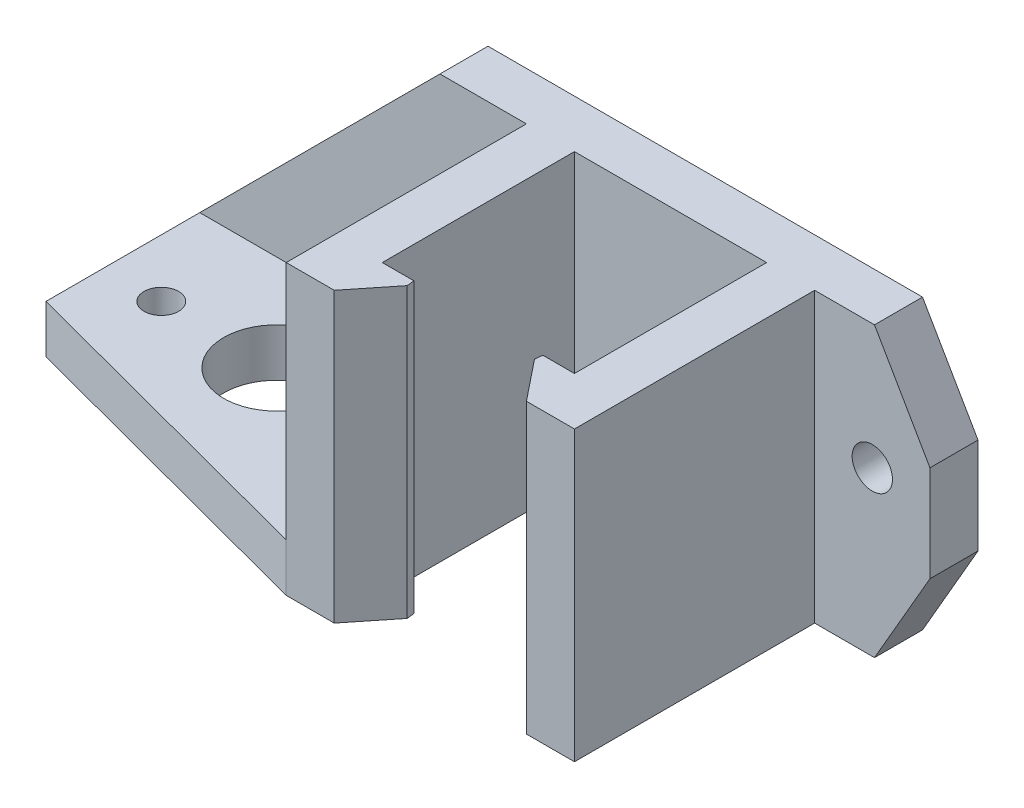
ISO-10303-21;
HEADER;
FILE_DESCRIPTION(('STEP AP214'),'2;1');
FILE_NAME('part.step','',(''),(''),'','','');
FILE_SCHEMA(('AUTOMOTIVE_DESIGN { 1 0 10303 214 1 1 1 1 }'));
ENDSEC;
DATA;
#1=APPLICATION_CONTEXT('core data for automotive mechanical design processes');
#2=APPLICATION_PROTOCOL_DEFINITION('international standard','automotive_design',2000,#1);
#3=PRODUCT_CONTEXT('',#1,'mechanical');
#4=PRODUCT('Part','Part','',(#3));
#5=PRODUCT_RELATED_PRODUCT_CATEGORY('part','',(#4));
#6=PRODUCT_DEFINITION_FORMATION('','',#4);
#7=PRODUCT_DEFINITION_CONTEXT('part definition',#1,'design');
#8=PRODUCT_DEFINITION('design','',#6,#7);
#9=PRODUCT_DEFINITION_SHAPE('','',#8);
#10=(LENGTH_UNIT() NAMED_UNIT(*) SI_UNIT(.MILLI.,.METRE.));
#11=(NAMED_UNIT(*) PLANE_ANGLE_UNIT() SI_UNIT($,.RADIAN.));
#12=(NAMED_UNIT(*) SI_UNIT($,.STERADIAN.) SOLID_ANGLE_UNIT());
#13=UNCERTAINTY_MEASURE_WITH_UNIT(LENGTH_MEASURE(1.E-05),#10,'distance_accuracy_value','');
#14=(GEOMETRIC_REPRESENTATION_CONTEXT(3) GLOBAL_UNCERTAINTY_ASSIGNED_CONTEXT((#13)) GLOBAL_UNIT_ASSIGNED_CONTEXT((#10,
#11,#12)) REPRESENTATION_CONTEXT('',''));
#15=CARTESIAN_POINT('',(0.,0.,0.));
#16=DIRECTION('',(0.,0.,1.));
#17=DIRECTION('',(1.,0.,0.));
#18=AXIS2_PLACEMENT_3D('',#15,#16,#17);
#19=CARTESIAN_POINT('',(15.,30.,15.));
#20=DIRECTION('',(0.,0.,-1.));
#21=DIRECTION('',(1.,0.,0.));
#22=AXIS2_PLACEMENT_3D('',#19,#20,#21);
#23=PLANE('',#22);
#24=DIRECTION('',(-1.,0.,0.));
#25=VECTOR('',#24,1.);
#26=CARTESIAN_POINT('',(15.,0.,15.));
#27=LINE('',#26,#25);
#28=CARTESIAN_POINT('',(-10.,0.,15.));
#29=VERTEX_POINT('',#28);
#30=CARTESIAN_POINT('',(-15.,0.,15.));
#31=VERTEX_POINT('',#30);
#32=EDGE_CURVE('E230',#29,#31,#27,.T.);
#33=ORIENTED_EDGE('',*,*,#32,.F.);
#34=DIRECTION('',(0.,1.,0.));
#35=VECTOR('',#34,1.);
#36=CARTESIAN_POINT('',(-10.,-5.00000000014378E-05,15.));
#37=LINE('',#36,#35);
#38=CARTESIAN_POINT('',(-10.,30.,15.));
#39=VERTEX_POINT('',#38);
#40=EDGE_CURVE('E192',#29,#39,#37,.T.);
#41=ORIENTED_EDGE('',*,*,#40,.T.);
#42=DIRECTION('',(-1.,0.,0.));
#43=VECTOR('',#42,1.);
#44=CARTESIAN_POINT('',(15.,30.,15.));
#45=LINE('',#44,#43);
#46=CARTESIAN_POINT('',(-15.,30.,15.));
#47=VERTEX_POINT('',#46);
#48=EDGE_CURVE('E208',#39,#47,#45,.T.);
#49=ORIENTED_EDGE('',*,*,#48,.T.);
#50=DIRECTION('',(0.,-1.,0.));
#51=VECTOR('',#50,1.);
#52=CARTESIAN_POINT('',(-15.,30.,15.));
#53=LINE('',#52,#51);
#54=CARTESIAN_POINT('',(-15.,5.,15.));
#55=VERTEX_POINT('',#54);
#56=EDGE_CURVE('E220',#47,#55,#53,.T.);
#57=ORIENTED_EDGE('',*,*,#56,.T.);
#58=DIRECTION('',(0.,1.,0.));
#59=VECTOR('',#58,1.);
#60=CARTESIAN_POINT('',(-15.,0.,15.));
#61=LINE('',#60,#59);
#62=EDGE_CURVE('E276',#31,#55,#61,.T.);
#63=ORIENTED_EDGE('',*,*,#62,.F.);
#64=EDGE_LOOP('',(#33,#41,#49,#57,#63));
#65=FACE_BOUND('',#64,.T.);
#66=ADVANCED_FACE('F34',(#65),#23,.F.);
#67=CARTESIAN_POINT('',(10.,0.,10.));
#68=DIRECTION('',(0.,0.,1.));
#69=DIRECTION('',(-1.,0.,0.));
#70=AXIS2_PLACEMENT_3D('',#67,#68,#69);
#71=PLANE('',#70);
#72=DIRECTION('',(-1.,0.,0.));
#73=VECTOR('',#72,1.);
#74=CARTESIAN_POINT('',(10.,30.,10.));
#75=LINE('',#74,#73);
#76=CARTESIAN_POINT('',(-6.71145824860367,30.,10.));
#77=VERTEX_POINT('',#76);
#78=CARTESIAN_POINT('',(-10.,30.,10.));
#79=VERTEX_POINT('',#78);
#80=EDGE_CURVE('E355',#77,#79,#75,.T.);
#81=ORIENTED_EDGE('',*,*,#80,.F.);
#82=DIRECTION('',(0.,-1.,0.));
#83=VECTOR('',#82,1.);
#84=CARTESIAN_POINT('',(-6.71145824860367,0.,10.));
#85=LINE('',#84,#83);
#86=CARTESIAN_POINT('',(-6.71145824860367,0.,10.));
#87=VERTEX_POINT('',#86);
#88=EDGE_CURVE('E42',#77,#87,#85,.T.);
#89=ORIENTED_EDGE('',*,*,#88,.T.);
#90=DIRECTION('',(-1.,0.,0.));
#91=VECTOR('',#90,1.);
#92=CARTESIAN_POINT('',(10.,0.,10.));
#93=LINE('',#92,#91);
#94=CARTESIAN_POINT('',(-10.,0.,10.));
#95=VERTEX_POINT('',#94);
#96=EDGE_CURVE('E353',#87,#95,#93,.T.);
#97=ORIENTED_EDGE('',*,*,#96,.T.);
#98=DIRECTION('',(0.,1.,0.));
#99=VECTOR('',#98,1.);
#100=CARTESIAN_POINT('',(-10.,0.,10.));
#101=LINE('',#100,#99);
#102=EDGE_CURVE('E384',#95,#79,#101,.T.);
#103=ORIENTED_EDGE('',*,*,#102,.T.);
#104=EDGE_LOOP('',(#81,#89,#97,#103));
#105=FACE_BOUND('',#104,.T.);
#106=ADVANCED_FACE('F351',(#105),#71,.F.);
#107=CARTESIAN_POINT('',(15.,30.,-15.));
#108=DIRECTION('',(-1.,0.,0.));
#109=DIRECTION('',(0.,0.,-1.));
#110=AXIS2_PLACEMENT_3D('',#107,#108,#109);
#111=PLANE('',#110);
#112=DIRECTION('',(0.,1.,0.));
#113=VECTOR('',#112,1.);
#114=CARTESIAN_POINT('',(15.,30.,-10.));
#115=LINE('',#114,#113);
#116=CARTESIAN_POINT('',(15.,0.,-10.));
#117=VERTEX_POINT('',#116);
#118=CARTESIAN_POINT('',(15.,30.,-10.));
#119=VERTEX_POINT('',#118);
#120=EDGE_CURVE('E236',#117,#119,#115,.T.);
#121=ORIENTED_EDGE('',*,*,#120,.T.);
#122=DIRECTION('',(0.,0.,1.));
#123=VECTOR('',#122,1.);
#124=CARTESIAN_POINT('',(15.,30.,-15.));
#125=LINE('',#124,#123);
#126=CARTESIAN_POINT('',(15.,30.,15.));
#127=VERTEX_POINT('',#126);
#128=EDGE_CURVE('E213',#119,#127,#125,.T.);
#129=ORIENTED_EDGE('',*,*,#128,.T.);
#130=DIRECTION('',(0.,-1.,0.));
#131=VECTOR('',#130,1.);
#132=CARTESIAN_POINT('',(15.,30.,15.));
#133=LINE('',#132,#131);
#134=CARTESIAN_POINT('',(15.,0.,15.));
#135=VERTEX_POINT('',#134);
#136=EDGE_CURVE('E205',#127,#135,#133,.T.);
#137=ORIENTED_EDGE('',*,*,#136,.T.);
#138=DIRECTION('',(0.,0.,1.));
#139=VECTOR('',#138,1.);
#140=CARTESIAN_POINT('',(15.,0.,-15.));
#141=LINE('',#140,#139);
#142=EDGE_CURVE('E226',#117,#135,#141,.T.);
#143=ORIENTED_EDGE('',*,*,#142,.F.);
#144=EDGE_LOOP('',(#121,#129,#137,#143));
#145=FACE_BOUND('',#144,.T.);
#146=ADVANCED_FACE('F430',(#145),#111,.F.);
#147=CARTESIAN_POINT('',(-15.,30.,-15.));
#148=DIRECTION('',(1.,0.,0.));
#149=DIRECTION('',(0.,0.,1.));
#150=AXIS2_PLACEMENT_3D('',#147,#148,#149);
#151=PLANE('',#150);
#152=DIRECTION('',(0.,-1.,0.));
#153=VECTOR('',#152,1.);
#154=CARTESIAN_POINT('',(-15.,30.,-10.));
#155=LINE('',#154,#153);
#156=CARTESIAN_POINT('',(-15.,30.,-10.));
#157=VERTEX_POINT('',#156);
#158=CARTESIAN_POINT('',(-15.,5.,-10.));
#159=VERTEX_POINT('',#158);
#160=EDGE_CURVE('E252',#157,#159,#155,.T.);
#161=ORIENTED_EDGE('',*,*,#160,.T.);
#162=DIRECTION('',(0.,0.,1.));
#163=VECTOR('',#162,1.);
#164=CARTESIAN_POINT('',(-15.,5.,15.));
#165=LINE('',#164,#163);
#166=EDGE_CURVE('E296',#159,#55,#165,.T.);
#167=ORIENTED_EDGE('',*,*,#166,.T.);
#168=ORIENTED_EDGE('',*,*,#56,.F.);
#169=DIRECTION('',(0.,0.,-1.));
#170=VECTOR('',#169,1.);
#171=CARTESIAN_POINT('',(-15.,30.,-15.));
#172=LINE('',#171,#170);
#173=EDGE_CURVE('E207',#47,#157,#172,.T.);
#174=ORIENTED_EDGE('',*,*,#173,.T.);
#175=EDGE_LOOP('',(#161,#167,#168,#174));
#176=FACE_BOUND('',#175,.T.);
#177=ADVANCED_FACE('F466',(#176),#151,.F.);
#178=CARTESIAN_POINT('',(-55.,5.,15.));
#179=DIRECTION('',(0.,-1.,0.));
#180=DIRECTION('',(0.,0.,-1.));
#181=AXIS2_PLACEMENT_3D('',#178,#179,#180);
#182=PLANE('',#181);
#183=CARTESIAN_POINT('',(-31.,5.,0.));
#184=DIRECTION('',(0.,1.,0.));
#185=DIRECTION('',(0.,0.,-1.));
#186=AXIS2_PLACEMENT_3D('',#183,#184,#185);
#187=CIRCLE('',#186,5.5);
#188=CARTESIAN_POINT('',(-31.,5.,-5.49999999999999));
#189=VERTEX_POINT('',#188);
#190=EDGE_CURVE('E290',#189,#189,#187,.T.);
#191=ORIENTED_EDGE('',*,*,#190,.F.);
#192=EDGE_LOOP('',(#191));
#193=FACE_BOUND('',#192,.T.);
#194=CARTESIAN_POINT('',(-19.,5.,0.));
#195=DIRECTION('',(0.,1.,0.));
#196=DIRECTION('',(0.,0.,-1.));
#197=AXIS2_PLACEMENT_3D('',#194,#195,#196);
#198=CIRCLE('',#197,1.8);
#199=CARTESIAN_POINT('',(-19.,5.,-1.8));
#200=VERTEX_POINT('',#199);
#201=EDGE_CURVE('E286',#200,#200,#198,.T.);
#202=ORIENTED_EDGE('',*,*,#201,.F.);
#203=EDGE_LOOP('',(#202));
#204=FACE_BOUND('',#203,.T.);
#205=CARTESIAN_POINT('',(-43.,5.,0.));
#206=DIRECTION('',(0.,1.,0.));
#207=DIRECTION('',(0.,0.,-1.));
#208=AXIS2_PLACEMENT_3D('',#205,#206,#207);
#209=CIRCLE('',#208,1.8);
#210=CARTESIAN_POINT('',(-43.,5.,-1.8));
#211=VERTEX_POINT('',#210);
#212=EDGE_CURVE('E282',#211,#211,#209,.T.);
#213=ORIENTED_EDGE('',*,*,#212,.F.);
#214=EDGE_LOOP('',(#213));
#215=FACE_BOUND('',#214,.T.);
#216=DIRECTION('',(1.,0.,0.));
#217=VECTOR('',#216,1.);
#218=CARTESIAN_POINT('',(-74.4950975679639,5.,-10.));
#219=LINE('',#218,#217);
#220=CARTESIAN_POINT('',(-49.,5.,-9.99999999999999));
#221=VERTEX_POINT('',#220);
#222=EDGE_CURVE('E259',#221,#159,#219,.T.);
#223=ORIENTED_EDGE('',*,*,#222,.F.);
#224=DIRECTION('',(0.,0.,1.));
#225=VECTOR('',#224,1.);
#226=CARTESIAN_POINT('',(-49.,5.,6.));
#227=LINE('',#226,#225);
#228=CARTESIAN_POINT('',(-49.,5.,6.));
#229=VERTEX_POINT('',#228);
#230=EDGE_CURVE('E263',#221,#229,#227,.T.);
#231=ORIENTED_EDGE('',*,*,#230,.T.);
#232=DIRECTION('',(0.966705227861512,0.,0.255892560316283));
#233=VECTOR('',#232,1.);
#234=CARTESIAN_POINT('',(-15.,5.,15.));
#235=LINE('',#234,#233);
#236=EDGE_CURVE('E268',#229,#55,#235,.T.);
#237=ORIENTED_EDGE('',*,*,#236,.T.);
#238=ORIENTED_EDGE('',*,*,#166,.F.);
#239=EDGE_LOOP('',(#223,#231,#237,#238));
#240=FACE_BOUND('',#239,.T.);
#241=ADVANCED_FACE('F457',(#193,#204,#215,#240),#182,.F.);
#242=CARTESIAN_POINT('',(10.,30.,15.));
#243=VERTEX_POINT('',#242);
#244=EDGE_CURVE('E199',#127,#243,#45,.T.);
#245=ORIENTED_EDGE('',*,*,#244,.T.);
#246=DIRECTION('',(0.,1.,0.));
#247=VECTOR('',#246,1.);
#248=CARTESIAN_POINT('',(10.,-5.00000000014378E-05,15.));
#249=LINE('',#248,#247);
#250=CARTESIAN_POINT('',(10.,0.,15.));
#251=VERTEX_POINT('',#250);
#252=EDGE_CURVE('E182',#251,#243,#249,.T.);
#253=ORIENTED_EDGE('',*,*,#252,.F.);
#254=EDGE_CURVE('E223',#135,#251,#27,.T.);
#255=ORIENTED_EDGE('',*,*,#254,.F.);
#256=ORIENTED_EDGE('',*,*,#136,.F.);
#257=EDGE_LOOP('',(#245,#253,#255,#256));
#258=FACE_BOUND('',#257,.T.);
#259=ADVANCED_FACE('F203',(#258),#23,.F.);
#260=CARTESIAN_POINT('',(15.,30.,-15.));
#261=DIRECTION('',(0.,0.,1.));
#262=DIRECTION('',(-1.,0.,0.));
#263=AXIS2_PLACEMENT_3D('',#260,#261,#262);
#264=PLANE('',#263);
#265=CARTESIAN_POINT('',(21.,17.,-15.));
#266=DIRECTION('',(0.,0.,-1.));
#267=DIRECTION('',(-1.,0.,0.));
#268=AXIS2_PLACEMENT_3D('',#265,#266,#267);
#269=CIRCLE('',#268,2.1);
#270=CARTESIAN_POINT('',(18.9,17.,-15.));
#271=VERTEX_POINT('',#270);
#272=EDGE_CURVE('E241',#271,#271,#269,.T.);
#273=ORIENTED_EDGE('',*,*,#272,.F.);
#274=EDGE_LOOP('',(#273));
#275=FACE_BOUND('',#274,.T.);
#276=CARTESIAN_POINT('',(-23.,17.,-15.));
#277=DIRECTION('',(0.,0.,-1.));
#278=DIRECTION('',(-1.,0.,0.));
#279=AXIS2_PLACEMENT_3D('',#276,#277,#278);
#280=CIRCLE('',#279,2.1);
#281=CARTESIAN_POINT('',(-25.1,17.,-15.));
#282=VERTEX_POINT('',#281);
#283=EDGE_CURVE('E249',#282,#282,#280,.T.);
#284=ORIENTED_EDGE('',*,*,#283,.F.);
#285=EDGE_LOOP('',(#284));
#286=FACE_BOUND('',#285,.T.);
#287=DIRECTION('',(0.,-1.,0.));
#288=VECTOR('',#287,1.);
#289=CARTESIAN_POINT('',(27.,30.,-15.));
#290=LINE('',#289,#288);
#291=CARTESIAN_POINT('',(27.,20.,-15.));
#292=VERTEX_POINT('',#291);
#293=CARTESIAN_POINT('',(27.,10.,-15.));
#294=VERTEX_POINT('',#293);
#295=EDGE_CURVE('E240',#292,#294,#290,.T.);
#296=ORIENTED_EDGE('',*,*,#295,.T.);
#297=DIRECTION('',(0.499999999999998,0.86602540378444,0.));
#298=VECTOR('',#297,1.);
#299=CARTESIAN_POINT('',(27.,10.,-15.));
#300=LINE('',#299,#298);
#301=CARTESIAN_POINT('',(21.2264973081038,0.,-15.));
#302=VERTEX_POINT('',#301);
#303=EDGE_CURVE('E318',#302,#294,#300,.T.);
#304=ORIENTED_EDGE('',*,*,#303,.F.);
#305=DIRECTION('',(1.,0.,0.));
#306=VECTOR('',#305,1.);
#307=CARTESIAN_POINT('',(15.,0.,-15.));
#308=LINE('',#307,#306);
#309=CARTESIAN_POINT('',(-49.,0.,-15.));
#310=VERTEX_POINT('',#309);
#311=EDGE_CURVE('E235',#310,#302,#308,.T.);
#312=ORIENTED_EDGE('',*,*,#311,.F.);
#313=DIRECTION('',(0.,1.,0.));
#314=VECTOR('',#313,1.);
#315=CARTESIAN_POINT('',(-49.,0.,-15.));
#316=LINE('',#315,#314);
#317=CARTESIAN_POINT('',(-49.,4.9999999999999,-15.));
#318=VERTEX_POINT('',#317);
#319=EDGE_CURVE('E271',#310,#318,#316,.T.);
#320=ORIENTED_EDGE('',*,*,#319,.T.);
#321=DIRECTION('',(-0.707106781186546,-0.707106781186549,0.));
#322=VECTOR('',#321,1.);
#323=CARTESIAN_POINT('',(-24.,30.,-15.));
#324=LINE('',#323,#322);
#325=CARTESIAN_POINT('',(-24.,30.,-15.));
#326=VERTEX_POINT('',#325);
#327=EDGE_CURVE('E305',#326,#318,#324,.T.);
#328=ORIENTED_EDGE('',*,*,#327,.F.);
#329=DIRECTION('',(1.,0.,0.));
#330=VECTOR('',#329,1.);
#331=CARTESIAN_POINT('',(15.,30.,-15.));
#332=LINE('',#331,#330);
#333=CARTESIAN_POINT('',(21.2264973081038,30.,-15.));
#334=VERTEX_POINT('',#333);
#335=EDGE_CURVE('E211',#326,#334,#332,.T.);
#336=ORIENTED_EDGE('',*,*,#335,.T.);
#337=DIRECTION('',(0.499999999999998,-0.86602540378444,0.));
#338=VECTOR('',#337,1.);
#339=CARTESIAN_POINT('',(27.,20.,-15.));
#340=LINE('',#339,#338);
#341=EDGE_CURVE('E323',#292,#334,#340,.F.);
#342=ORIENTED_EDGE('',*,*,#341,.F.);
#343=EDGE_LOOP('',(#296,#304,#312,#320,#328,#336,#342));
#344=FACE_BOUND('',#343,.T.);
#345=ADVANCED_FACE('F435',(#275,#286,#344),#264,.F.);
#346=CARTESIAN_POINT('',(0.,30.,0.));
#347=DIRECTION('',(0.,1.,0.));
#348=DIRECTION('',(0.,0.,1.));
#349=AXIS2_PLACEMENT_3D('',#346,#347,#348);
#350=PLANE('',#349);
#351=CARTESIAN_POINT('',(10.,30.,10.));
#352=VERTEX_POINT('',#351);
#353=CARTESIAN_POINT('',(6.71145824860366,30.,10.));
#354=VERTEX_POINT('',#353);
#355=EDGE_CURVE('E374',#352,#354,#75,.T.);
#356=ORIENTED_EDGE('',*,*,#355,.T.);
#357=DIRECTION('',(0.110431526074844,0.,-0.993883734673619));
#358=VECTOR('',#357,1.);
#359=CARTESIAN_POINT('',(7.72717217240116,30.,0.858574685822331));
#360=LINE('',#359,#358);
#361=CARTESIAN_POINT('',(6.62469504755444,30.,10.780868809443));
#362=VERTEX_POINT('',#361);
#363=EDGE_CURVE('E201',#354,#362,#360,.F.);
#364=ORIENTED_EDGE('',*,*,#363,.T.);
#365=DIRECTION('',(-0.624695047554424,0.,-0.78086880944303));
#366=VECTOR('',#365,1.);
#367=CARTESIAN_POINT('',(6.,30.,10.));
#368=LINE('',#367,#366);
#369=EDGE_CURVE('E185',#243,#362,#368,.T.);
#370=ORIENTED_EDGE('',*,*,#369,.F.);
#371=ORIENTED_EDGE('',*,*,#244,.F.);
#372=ORIENTED_EDGE('',*,*,#128,.F.);
#373=DIRECTION('',(-1.,0.,0.));
#374=VECTOR('',#373,1.);
#375=CARTESIAN_POINT('',(27.,30.,-10.));
#376=LINE('',#375,#374);
#377=CARTESIAN_POINT('',(21.2264973081038,30.,-10.));
#378=VERTEX_POINT('',#377);
#379=EDGE_CURVE('E327',#378,#119,#376,.T.);
#380=ORIENTED_EDGE('',*,*,#379,.F.);
#381=DIRECTION('',(0.,0.,1.));
#382=VECTOR('',#381,1.);
#383=CARTESIAN_POINT('',(21.2264973081038,30.,0.));
#384=LINE('',#383,#382);
#385=EDGE_CURVE('E326',#334,#378,#384,.T.);
#386=ORIENTED_EDGE('',*,*,#385,.F.);
#387=ORIENTED_EDGE('',*,*,#335,.F.);
#388=DIRECTION('',(0.,0.,-1.));
#389=VECTOR('',#388,1.);
#390=CARTESIAN_POINT('',(-24.,30.,-15.));
#391=LINE('',#390,#389);
#392=CARTESIAN_POINT('',(-24.,30.,-10.));
#393=VERTEX_POINT('',#392);
#394=EDGE_CURVE('E303',#393,#326,#391,.T.);
#395=ORIENTED_EDGE('',*,*,#394,.F.);
#396=DIRECTION('',(1.,0.,0.));
#397=VECTOR('',#396,1.);
#398=CARTESIAN_POINT('',(-74.4950975679639,30.,-10.));
#399=LINE('',#398,#397);
#400=EDGE_CURVE('E261',#393,#157,#399,.T.);
#401=ORIENTED_EDGE('',*,*,#400,.T.);
#402=ORIENTED_EDGE('',*,*,#173,.F.);
#403=ORIENTED_EDGE('',*,*,#48,.F.);
#404=DIRECTION('',(-0.624695047554425,0.,0.78086880944303));
#405=VECTOR('',#404,1.);
#406=CARTESIAN_POINT('',(-10.,30.,15.));
#407=LINE('',#406,#405);
#408=CARTESIAN_POINT('',(-6.62469504755444,30.,10.780868809443));
#409=VERTEX_POINT('',#408);
#410=EDGE_CURVE('E193',#409,#39,#407,.T.);
#411=ORIENTED_EDGE('',*,*,#410,.F.);
#412=DIRECTION('',(0.110431526074849,0.,0.993883734673619));
#413=VECTOR('',#412,1.);
#414=CARTESIAN_POINT('',(-7.72717217240121,30.,0.858574685822379));
#415=LINE('',#414,#413);
#416=EDGE_CURVE('E342',#409,#77,#415,.F.);
#417=ORIENTED_EDGE('',*,*,#416,.T.);
#418=ORIENTED_EDGE('',*,*,#80,.T.);
#419=DIRECTION('',(0.,0.,-1.));
#420=VECTOR('',#419,1.);
#421=CARTESIAN_POINT('',(-10.,30.,-10.));
#422=LINE('',#421,#420);
#423=CARTESIAN_POINT('',(-10.,30.,-10.));
#424=VERTEX_POINT('',#423);
#425=EDGE_CURVE('E376',#79,#424,#422,.T.);
#426=ORIENTED_EDGE('',*,*,#425,.T.);
#427=DIRECTION('',(1.,0.,0.));
#428=VECTOR('',#427,1.);
#429=CARTESIAN_POINT('',(10.,30.,-10.));
#430=LINE('',#429,#428);
#431=CARTESIAN_POINT('',(10.,30.,-10.));
#432=VERTEX_POINT('',#431);
#433=EDGE_CURVE('E365',#424,#432,#430,.T.);
#434=ORIENTED_EDGE('',*,*,#433,.T.);
#435=DIRECTION('',(0.,0.,1.));
#436=VECTOR('',#435,1.);
#437=CARTESIAN_POINT('',(10.,30.,-10.));
#438=LINE('',#437,#436);
#439=EDGE_CURVE('E300',#432,#352,#438,.T.);
#440=ORIENTED_EDGE('',*,*,#439,.T.);
#441=EDGE_LOOP('',(#356,#364,#370,#371,#372,#380,#386,#387,#395,#401,#402,#403,#411,#417,#418,
#426,#434,#440));
#442=FACE_BOUND('',#441,.T.);
#443=ADVANCED_FACE('F197',(#442),#350,.T.);
#444=CARTESIAN_POINT('',(0.,0.,0.));
#445=DIRECTION('',(0.,1.,0.));
#446=DIRECTION('',(0.,0.,1.));
#447=AXIS2_PLACEMENT_3D('',#444,#445,#446);
#448=PLANE('',#447);
#449=CARTESIAN_POINT('',(-43.,0.,0.));
#450=DIRECTION('',(0.,1.,0.));
#451=DIRECTION('',(0.,0.,-1.));
#452=AXIS2_PLACEMENT_3D('',#449,#450,#451);
#453=CIRCLE('',#452,1.8);
#454=CARTESIAN_POINT('',(-43.,0.,-1.8));
#455=VERTEX_POINT('',#454);
#456=EDGE_CURVE('E279',#455,#455,#453,.T.);
#457=ORIENTED_EDGE('',*,*,#456,.T.);
#458=EDGE_LOOP('',(#457));
#459=FACE_BOUND('',#458,.T.);
#460=CARTESIAN_POINT('',(-19.,0.,0.));
#461=DIRECTION('',(0.,1.,0.));
#462=DIRECTION('',(0.,0.,-1.));
#463=AXIS2_PLACEMENT_3D('',#460,#461,#462);
#464=CIRCLE('',#463,1.8);
#465=CARTESIAN_POINT('',(-19.,0.,-1.8));
#466=VERTEX_POINT('',#465);
#467=EDGE_CURVE('E283',#466,#466,#464,.T.);
#468=ORIENTED_EDGE('',*,*,#467,.T.);
#469=EDGE_LOOP('',(#468));
#470=FACE_BOUND('',#469,.T.);
#471=CARTESIAN_POINT('',(-31.,0.,0.));
#472=DIRECTION('',(0.,1.,0.));
#473=DIRECTION('',(0.,0.,-1.));
#474=AXIS2_PLACEMENT_3D('',#471,#472,#473);
#475=CIRCLE('',#474,5.5);
#476=CARTESIAN_POINT('',(-31.,0.,-5.49999999999999));
#477=VERTEX_POINT('',#476);
#478=EDGE_CURVE('E287',#477,#477,#475,.T.);
#479=ORIENTED_EDGE('',*,*,#478,.T.);
#480=EDGE_LOOP('',(#479));
#481=FACE_BOUND('',#480,.T.);
#482=DIRECTION('',(-0.624695047554424,0.,-0.78086880944303));
#483=VECTOR('',#482,1.);
#484=CARTESIAN_POINT('',(-1.21951219512195,0.,0.975609756097561));
#485=LINE('',#484,#483);
#486=CARTESIAN_POINT('',(6.62469504755444,0.,10.780868809443));
#487=VERTEX_POINT('',#486);
#488=EDGE_CURVE('E188',#251,#487,#485,.T.);
#489=ORIENTED_EDGE('',*,*,#488,.T.);
#490=DIRECTION('',(-0.110431526074844,0.,0.993883734673619));
#491=VECTOR('',#490,1.);
#492=CARTESIAN_POINT('',(6.71145824860366,0.,10.));
#493=LINE('',#492,#491);
#494=CARTESIAN_POINT('',(6.71145824860366,0.,10.));
#495=VERTEX_POINT('',#494);
#496=EDGE_CURVE('E348',#487,#495,#493,.F.);
#497=ORIENTED_EDGE('',*,*,#496,.T.);
#498=CARTESIAN_POINT('',(10.,0.,10.));
#499=VERTEX_POINT('',#498);
#500=EDGE_CURVE('E362',#499,#495,#93,.T.);
#501=ORIENTED_EDGE('',*,*,#500,.F.);
#502=DIRECTION('',(0.,0.,1.));
#503=VECTOR('',#502,1.);
#504=CARTESIAN_POINT('',(10.,0.,-10.));
#505=LINE('',#504,#503);
#506=CARTESIAN_POINT('',(10.,0.,-10.));
#507=VERTEX_POINT('',#506);
#508=EDGE_CURVE('E293',#507,#499,#505,.T.);
#509=ORIENTED_EDGE('',*,*,#508,.F.);
#510=DIRECTION('',(1.,0.,0.));
#511=VECTOR('',#510,1.);
#512=CARTESIAN_POINT('',(10.,0.,-10.));
#513=LINE('',#512,#511);
#514=CARTESIAN_POINT('',(-10.,0.,-10.));
#515=VERTEX_POINT('',#514);
#516=EDGE_CURVE('E368',#515,#507,#513,.T.);
#517=ORIENTED_EDGE('',*,*,#516,.F.);
#518=DIRECTION('',(0.,0.,-1.));
#519=VECTOR('',#518,1.);
#520=CARTESIAN_POINT('',(-10.,0.,-10.));
#521=LINE('',#520,#519);
#522=EDGE_CURVE('E361',#95,#515,#521,.T.);
#523=ORIENTED_EDGE('',*,*,#522,.F.);
#524=ORIENTED_EDGE('',*,*,#96,.F.);
#525=DIRECTION('',(-0.110431526074849,0.,-0.993883734673619));
#526=VECTOR('',#525,1.);
#527=CARTESIAN_POINT('',(-6.71145824860367,0.,10.));
#528=LINE('',#527,#526);
#529=CARTESIAN_POINT('',(-6.62469504755444,0.,10.780868809443));
#530=VERTEX_POINT('',#529);
#531=EDGE_CURVE('E49',#87,#530,#528,.F.);
#532=ORIENTED_EDGE('',*,*,#531,.T.);
#533=DIRECTION('',(-0.624695047554424,0.,0.78086880944303));
#534=VECTOR('',#533,1.);
#535=CARTESIAN_POINT('',(1.21951219512195,0.,0.975609756097562));
#536=LINE('',#535,#534);
#537=EDGE_CURVE('E401',#530,#29,#536,.T.);
#538=ORIENTED_EDGE('',*,*,#537,.T.);
#539=ORIENTED_EDGE('',*,*,#32,.T.);
#540=DIRECTION('',(0.966705227861512,0.,0.255892560316283));
#541=VECTOR('',#540,1.);
#542=CARTESIAN_POINT('',(-15.,0.,15.));
#543=LINE('',#542,#541);
#544=CARTESIAN_POINT('',(-49.,0.,6.));
#545=VERTEX_POINT('',#544);
#546=EDGE_CURVE('E267',#545,#31,#543,.T.);
#547=ORIENTED_EDGE('',*,*,#546,.F.);
#548=DIRECTION('',(0.,0.,1.));
#549=VECTOR('',#548,1.);
#550=CARTESIAN_POINT('',(-49.,0.,6.));
#551=LINE('',#550,#549);
#552=EDGE_CURVE('E264',#310,#545,#551,.T.);
#553=ORIENTED_EDGE('',*,*,#552,.F.);
#554=ORIENTED_EDGE('',*,*,#311,.T.);
#555=DIRECTION('',(0.,0.,-1.));
#556=VECTOR('',#555,1.);
#557=CARTESIAN_POINT('',(21.2264973081038,0.,-15.));
#558=LINE('',#557,#556);
#559=CARTESIAN_POINT('',(21.2264973081038,0.,-9.99999999999999));
#560=VERTEX_POINT('',#559);
#561=EDGE_CURVE('E337',#560,#302,#558,.T.);
#562=ORIENTED_EDGE('',*,*,#561,.F.);
#563=DIRECTION('',(-1.,0.,0.));
#564=VECTOR('',#563,1.);
#565=CARTESIAN_POINT('',(27.,0.,-9.99999999999999));
#566=LINE('',#565,#564);
#567=EDGE_CURVE('E256',#560,#117,#566,.T.);
#568=ORIENTED_EDGE('',*,*,#567,.T.);
#569=ORIENTED_EDGE('',*,*,#142,.T.);
#570=ORIENTED_EDGE('',*,*,#254,.T.);
#571=EDGE_LOOP('',(#489,#497,#501,#509,#517,#523,#524,#532,#538,#539,#547,#553,#554,#562,#568,
#569,#570));
#572=FACE_BOUND('',#571,.T.);
#573=ADVANCED_FACE('F358',(#459,#470,#481,#572),#448,.F.);
#574=CARTESIAN_POINT('',(10.,0.,-10.));
#575=DIRECTION('',(1.,0.,0.));
#576=DIRECTION('',(0.,0.,1.));
#577=AXIS2_PLACEMENT_3D('',#574,#575,#576);
#578=PLANE('',#577);
#579=ORIENTED_EDGE('',*,*,#439,.F.);
#580=DIRECTION('',(0.,1.,0.));
#581=VECTOR('',#580,1.);
#582=CARTESIAN_POINT('',(10.,0.,-10.));
#583=LINE('',#582,#581);
#584=EDGE_CURVE('E231',#507,#432,#583,.T.);
#585=ORIENTED_EDGE('',*,*,#584,.F.);
#586=ORIENTED_EDGE('',*,*,#508,.T.);
#587=DIRECTION('',(0.,1.,0.));
#588=VECTOR('',#587,1.);
#589=CARTESIAN_POINT('',(10.,0.,10.));
#590=LINE('',#589,#588);
#591=EDGE_CURVE('E371',#499,#352,#590,.T.);
#592=ORIENTED_EDGE('',*,*,#591,.T.);
#593=EDGE_LOOP('',(#579,#585,#586,#592));
#594=FACE_BOUND('',#593,.T.);
#595=ADVANCED_FACE('F388',(#594),#578,.F.);
#596=CARTESIAN_POINT('',(10.,0.,-10.));
#597=DIRECTION('',(0.,0.,-1.));
#598=DIRECTION('',(1.,0.,0.));
#599=AXIS2_PLACEMENT_3D('',#596,#597,#598);
#600=PLANE('',#599);
#601=ORIENTED_EDGE('',*,*,#433,.F.);
#602=DIRECTION('',(0.,1.,0.));
#603=VECTOR('',#602,1.);
#604=CARTESIAN_POINT('',(-10.,0.,-10.));
#605=LINE('',#604,#603);
#606=EDGE_CURVE('E382',#515,#424,#605,.T.);
#607=ORIENTED_EDGE('',*,*,#606,.F.);
#608=ORIENTED_EDGE('',*,*,#516,.T.);
#609=ORIENTED_EDGE('',*,*,#584,.T.);
#610=EDGE_LOOP('',(#601,#607,#608,#609));
#611=FACE_BOUND('',#610,.T.);
#612=ADVANCED_FACE('F397',(#611),#600,.F.);
#613=CARTESIAN_POINT('',(-10.,0.,-10.));
#614=DIRECTION('',(-1.,0.,0.));
#615=DIRECTION('',(0.,0.,-1.));
#616=AXIS2_PLACEMENT_3D('',#613,#614,#615);
#617=PLANE('',#616);
#618=ORIENTED_EDGE('',*,*,#425,.F.);
#619=ORIENTED_EDGE('',*,*,#102,.F.);
#620=ORIENTED_EDGE('',*,*,#522,.T.);
#621=ORIENTED_EDGE('',*,*,#606,.T.);
#622=EDGE_LOOP('',(#618,#619,#620,#621));
#623=FACE_BOUND('',#622,.T.);
#624=ADVANCED_FACE('F513',(#623),#617,.F.);
#625=ORIENTED_EDGE('',*,*,#500,.T.);
#626=DIRECTION('',(0.,1.,0.));
#627=VECTOR('',#626,1.);
#628=CARTESIAN_POINT('',(6.71145824860366,0.,10.));
#629=LINE('',#628,#627);
#630=EDGE_CURVE('E339',#495,#354,#629,.T.);
#631=ORIENTED_EDGE('',*,*,#630,.T.);
#632=ORIENTED_EDGE('',*,*,#355,.F.);
#633=ORIENTED_EDGE('',*,*,#591,.F.);
#634=EDGE_LOOP('',(#625,#631,#632,#633));
#635=FACE_BOUND('',#634,.T.);
#636=ADVANCED_FACE('F392',(#635),#71,.F.);
#637=CARTESIAN_POINT('',(-31.,30.000025,0.));
#638=DIRECTION('',(0.,-1.,0.));
#639=DIRECTION('',(0.,0.,-1.));
#640=AXIS2_PLACEMENT_3D('',#637,#638,#639);
#641=CYLINDRICAL_SURFACE('',#640,5.5);
#642=ORIENTED_EDGE('',*,*,#478,.F.);
#643=EDGE_LOOP('',(#642));
#644=FACE_BOUND('',#643,.T.);
#645=ORIENTED_EDGE('',*,*,#190,.T.);
#646=EDGE_LOOP('',(#645));
#647=FACE_BOUND('',#646,.T.);
#648=ADVANCED_FACE('F509',(#644,#647),#641,.F.);
#649=CARTESIAN_POINT('',(-19.,30.000025,0.));
#650=DIRECTION('',(0.,-1.,0.));
#651=DIRECTION('',(0.,0.,-1.));
#652=AXIS2_PLACEMENT_3D('',#649,#650,#651);
#653=CYLINDRICAL_SURFACE('',#652,1.8);
#654=ORIENTED_EDGE('',*,*,#467,.F.);
#655=EDGE_LOOP('',(#654));
#656=FACE_BOUND('',#655,.T.);
#657=ORIENTED_EDGE('',*,*,#201,.T.);
#658=EDGE_LOOP('',(#657));
#659=FACE_BOUND('',#658,.T.);
#660=ADVANCED_FACE('F534',(#656,#659),#653,.F.);
#661=CARTESIAN_POINT('',(-43.,30.000025,0.));
#662=DIRECTION('',(0.,-1.,0.));
#663=DIRECTION('',(0.,0.,-1.));
#664=AXIS2_PLACEMENT_3D('',#661,#662,#663);
#665=CYLINDRICAL_SURFACE('',#664,1.8);
#666=ORIENTED_EDGE('',*,*,#456,.F.);
#667=EDGE_LOOP('',(#666));
#668=FACE_BOUND('',#667,.T.);
#669=ORIENTED_EDGE('',*,*,#212,.T.);
#670=EDGE_LOOP('',(#669));
#671=FACE_BOUND('',#670,.T.);
#672=ADVANCED_FACE('F538',(#668,#671),#665,.F.);
#673=CARTESIAN_POINT('',(-15.,0.,15.));
#674=DIRECTION('',(0.255892560316283,0.,-0.966705227861512));
#675=DIRECTION('',(0.966705227861512,0.,0.255892560316283));
#676=AXIS2_PLACEMENT_3D('',#673,#674,#675);
#677=PLANE('',#676);
#678=ORIENTED_EDGE('',*,*,#236,.F.);
#679=DIRECTION('',(0.,1.,0.));
#680=VECTOR('',#679,1.);
#681=CARTESIAN_POINT('',(-49.,0.,6.));
#682=LINE('',#681,#680);
#683=EDGE_CURVE('E274',#545,#229,#682,.T.);
#684=ORIENTED_EDGE('',*,*,#683,.F.);
#685=ORIENTED_EDGE('',*,*,#546,.T.);
#686=ORIENTED_EDGE('',*,*,#62,.T.);
#687=EDGE_LOOP('',(#678,#684,#685,#686));
#688=FACE_BOUND('',#687,.T.);
#689=ADVANCED_FACE('F543',(#688),#677,.F.);
#690=CARTESIAN_POINT('',(-49.,0.,6.));
#691=DIRECTION('',(1.,0.,0.));
#692=DIRECTION('',(0.,-1.,0.));
#693=AXIS2_PLACEMENT_3D('',#690,#691,#692);
#694=PLANE('',#693);
#695=ORIENTED_EDGE('',*,*,#319,.F.);
#696=ORIENTED_EDGE('',*,*,#552,.T.);
#697=ORIENTED_EDGE('',*,*,#683,.T.);
#698=ORIENTED_EDGE('',*,*,#230,.F.);
#699=DIRECTION('',(0.,0.,1.));
#700=VECTOR('',#699,1.);
#701=CARTESIAN_POINT('',(-49.,4.9999999999999,-10.));
#702=LINE('',#701,#700);
#703=EDGE_CURVE('E307',#318,#221,#702,.T.);
#704=ORIENTED_EDGE('',*,*,#703,.F.);
#705=EDGE_LOOP('',(#695,#696,#697,#698,#704));
#706=FACE_BOUND('',#705,.T.);
#707=ADVANCED_FACE('F481',(#706),#694,.F.);
#708=CARTESIAN_POINT('',(-74.4950975679639,30.,-10.));
#709=DIRECTION('',(0.,0.,-1.));
#710=DIRECTION('',(0.,1.,0.));
#711=AXIS2_PLACEMENT_3D('',#708,#709,#710);
#712=PLANE('',#711);
#713=CARTESIAN_POINT('',(-23.,17.,-10.));
#714=DIRECTION('',(0.,0.,-1.));
#715=DIRECTION('',(-1.,0.,0.));
#716=AXIS2_PLACEMENT_3D('',#713,#714,#715);
#717=CIRCLE('',#716,2.1);
#718=CARTESIAN_POINT('',(-25.1,17.,-10.));
#719=VERTEX_POINT('',#718);
#720=EDGE_CURVE('E253',#719,#719,#717,.T.);
#721=ORIENTED_EDGE('',*,*,#720,.T.);
#722=EDGE_LOOP('',(#721));
#723=FACE_BOUND('',#722,.T.);
#724=ORIENTED_EDGE('',*,*,#222,.T.);
#725=ORIENTED_EDGE('',*,*,#160,.F.);
#726=ORIENTED_EDGE('',*,*,#400,.F.);
#727=DIRECTION('',(0.707106781186546,0.707106781186549,0.));
#728=VECTOR('',#727,1.);
#729=CARTESIAN_POINT('',(-24.,30.,-10.));
#730=LINE('',#729,#728);
#731=EDGE_CURVE('E232',#221,#393,#730,.T.);
#732=ORIENTED_EDGE('',*,*,#731,.F.);
#733=EDGE_LOOP('',(#724,#725,#726,#732));
#734=FACE_BOUND('',#733,.T.);
#735=ADVANCED_FACE('F469',(#723,#734),#712,.F.);
#736=CARTESIAN_POINT('',(-24.,30.,0.));
#737=DIRECTION('',(-0.707106781186549,0.707106781186546,0.));
#738=DIRECTION('',(0.,0.,1.));
#739=AXIS2_PLACEMENT_3D('',#736,#737,#738);
#740=PLANE('',#739);
#741=ORIENTED_EDGE('',*,*,#731,.T.);
#742=ORIENTED_EDGE('',*,*,#394,.T.);
#743=ORIENTED_EDGE('',*,*,#327,.T.);
#744=ORIENTED_EDGE('',*,*,#703,.T.);
#745=EDGE_LOOP('',(#741,#742,#743,#744));
#746=FACE_BOUND('',#745,.T.);
#747=ADVANCED_FACE('F471',(#746),#740,.T.);
#748=CARTESIAN_POINT('',(-23.,17.,-15.));
#749=DIRECTION('',(0.,0.,1.));
#750=DIRECTION('',(-1.,0.,0.));
#751=AXIS2_PLACEMENT_3D('',#748,#749,#750);
#752=CYLINDRICAL_SURFACE('',#751,2.1);
#753=ORIENTED_EDGE('',*,*,#283,.T.);
#754=EDGE_LOOP('',(#753));
#755=FACE_BOUND('',#754,.T.);
#756=ORIENTED_EDGE('',*,*,#720,.F.);
#757=EDGE_LOOP('',(#756));
#758=FACE_BOUND('',#757,.T.);
#759=ADVANCED_FACE('F473',(#755,#758),#752,.F.);
#760=CARTESIAN_POINT('',(27.,30.,-10.));
#761=DIRECTION('',(0.,0.,-1.));
#762=DIRECTION('',(1.,0.,0.));
#763=AXIS2_PLACEMENT_3D('',#760,#761,#762);
#764=PLANE('',#763);
#765=CARTESIAN_POINT('',(21.,17.,-10.));
#766=DIRECTION('',(0.,0.,-1.));
#767=DIRECTION('',(-1.,0.,0.));
#768=AXIS2_PLACEMENT_3D('',#765,#766,#767);
#769=CIRCLE('',#768,2.1);
#770=CARTESIAN_POINT('',(18.9,17.,-10.));
#771=VERTEX_POINT('',#770);
#772=EDGE_CURVE('E403',#771,#771,#769,.T.);
#773=ORIENTED_EDGE('',*,*,#772,.T.);
#774=EDGE_LOOP('',(#773));
#775=FACE_BOUND('',#774,.T.);
#776=ORIENTED_EDGE('',*,*,#379,.T.);
#777=ORIENTED_EDGE('',*,*,#120,.F.);
#778=ORIENTED_EDGE('',*,*,#567,.F.);
#779=DIRECTION('',(-0.499999999999998,-0.86602540378444,0.));
#780=VECTOR('',#779,1.);
#781=CARTESIAN_POINT('',(27.,10.,-10.));
#782=LINE('',#781,#780);
#783=CARTESIAN_POINT('',(27.,10.,-10.));
#784=VERTEX_POINT('',#783);
#785=EDGE_CURVE('E331',#784,#560,#782,.T.);
#786=ORIENTED_EDGE('',*,*,#785,.F.);
#787=DIRECTION('',(0.,1.,0.));
#788=VECTOR('',#787,1.);
#789=CARTESIAN_POINT('',(27.,30.,-10.));
#790=LINE('',#789,#788);
#791=CARTESIAN_POINT('',(27.,20.,-10.));
#792=VERTEX_POINT('',#791);
#793=EDGE_CURVE('E247',#784,#792,#790,.T.);
#794=ORIENTED_EDGE('',*,*,#793,.T.);
#795=DIRECTION('',(-0.499999999999998,0.86602540378444,0.));
#796=VECTOR('',#795,1.);
#797=CARTESIAN_POINT('',(27.,20.,-10.));
#798=LINE('',#797,#796);
#799=EDGE_CURVE('E334',#378,#792,#798,.F.);
#800=ORIENTED_EDGE('',*,*,#799,.F.);
#801=EDGE_LOOP('',(#776,#777,#778,#786,#794,#800));
#802=FACE_BOUND('',#801,.T.);
#803=ADVANCED_FACE('F419',(#775,#802),#764,.F.);
#804=CARTESIAN_POINT('',(27.,0.,0.));
#805=DIRECTION('',(1.,0.,0.));
#806=DIRECTION('',(0.,0.,1.));
#807=AXIS2_PLACEMENT_3D('',#804,#805,#806);
#808=PLANE('',#807);
#809=ORIENTED_EDGE('',*,*,#793,.F.);
#810=DIRECTION('',(0.,0.,1.));
#811=VECTOR('',#810,1.);
#812=CARTESIAN_POINT('',(27.,10.,-9.99999999999999));
#813=LINE('',#812,#811);
#814=EDGE_CURVE('E311',#294,#784,#813,.T.);
#815=ORIENTED_EDGE('',*,*,#814,.F.);
#816=ORIENTED_EDGE('',*,*,#295,.F.);
#817=DIRECTION('',(0.,0.,-1.));
#818=VECTOR('',#817,1.);
#819=CARTESIAN_POINT('',(27.,20.,0.));
#820=LINE('',#819,#818);
#821=EDGE_CURVE('E313',#792,#292,#820,.T.);
#822=ORIENTED_EDGE('',*,*,#821,.F.);
#823=EDGE_LOOP('',(#809,#815,#816,#822));
#824=FACE_BOUND('',#823,.T.);
#825=ADVANCED_FACE('F422',(#824),#808,.T.);
#826=CARTESIAN_POINT('',(27.,20.,0.));
#827=DIRECTION('',(-0.86602540378444,-0.499999999999998,0.));
#828=DIRECTION('',(0.,0.,-1.));
#829=AXIS2_PLACEMENT_3D('',#826,#827,#828);
#830=PLANE('',#829);
#831=ORIENTED_EDGE('',*,*,#799,.T.);
#832=ORIENTED_EDGE('',*,*,#821,.T.);
#833=ORIENTED_EDGE('',*,*,#341,.T.);
#834=ORIENTED_EDGE('',*,*,#385,.T.);
#835=EDGE_LOOP('',(#831,#832,#833,#834));
#836=FACE_BOUND('',#835,.T.);
#837=ADVANCED_FACE('F424',(#836),#830,.F.);
#838=CARTESIAN_POINT('',(27.,10.,0.));
#839=DIRECTION('',(0.86602540378444,-0.499999999999998,0.));
#840=DIRECTION('',(0.,0.,-1.));
#841=AXIS2_PLACEMENT_3D('',#838,#839,#840);
#842=PLANE('',#841);
#843=ORIENTED_EDGE('',*,*,#303,.T.);
#844=ORIENTED_EDGE('',*,*,#814,.T.);
#845=ORIENTED_EDGE('',*,*,#785,.T.);
#846=ORIENTED_EDGE('',*,*,#561,.T.);
#847=EDGE_LOOP('',(#843,#844,#845,#846));
#848=FACE_BOUND('',#847,.T.);
#849=ADVANCED_FACE('F434',(#848),#842,.T.);
#850=CARTESIAN_POINT('',(21.,17.,-15.));
#851=DIRECTION('',(0.,0.,1.));
#852=DIRECTION('',(-1.,0.,0.));
#853=AXIS2_PLACEMENT_3D('',#850,#851,#852);
#854=CYLINDRICAL_SURFACE('',#853,2.1);
#855=ORIENTED_EDGE('',*,*,#272,.T.);
#856=EDGE_LOOP('',(#855));
#857=FACE_BOUND('',#856,.T.);
#858=ORIENTED_EDGE('',*,*,#772,.F.);
#859=EDGE_LOOP('',(#858));
#860=FACE_BOUND('',#859,.T.);
#861=ADVANCED_FACE('F558',(#857,#860),#854,.F.);
#862=CARTESIAN_POINT('',(6.,-5.00000000014378E-05,10.));
#863=DIRECTION('',(0.78086880944303,0.,-0.624695047554424));
#864=DIRECTION('',(-0.624695047554424,0.,-0.78086880944303));
#865=AXIS2_PLACEMENT_3D('',#862,#863,#864);
#866=PLANE('',#865);
#867=ORIENTED_EDGE('',*,*,#369,.T.);
#868=DIRECTION('',(0.,-1.,0.));
#869=VECTOR('',#868,1.);
#870=CARTESIAN_POINT('',(6.62469504755444,-5.00000000014378E-05,10.780868809443));
#871=LINE('',#870,#869);
#872=EDGE_CURVE('E345',#362,#487,#871,.T.);
#873=ORIENTED_EDGE('',*,*,#872,.T.);
#874=ORIENTED_EDGE('',*,*,#488,.F.);
#875=ORIENTED_EDGE('',*,*,#252,.T.);
#876=EDGE_LOOP('',(#867,#873,#874,#875));
#877=FACE_BOUND('',#876,.T.);
#878=ADVANCED_FACE('F184',(#877),#866,.F.);
#879=CARTESIAN_POINT('',(-10.,-5.00000000014378E-05,15.));
#880=DIRECTION('',(-0.78086880944303,0.,-0.624695047554424));
#881=DIRECTION('',(-0.624695047554424,0.,0.78086880944303));
#882=AXIS2_PLACEMENT_3D('',#879,#880,#881);
#883=PLANE('',#882);
#884=ORIENTED_EDGE('',*,*,#537,.F.);
#885=DIRECTION('',(0.,1.,0.));
#886=VECTOR('',#885,1.);
#887=CARTESIAN_POINT('',(-6.62469504755444,-5.00000000014378E-05,10.780868809443));
#888=LINE('',#887,#886);
#889=EDGE_CURVE('E11',#530,#409,#888,.T.);
#890=ORIENTED_EDGE('',*,*,#889,.T.);
#891=ORIENTED_EDGE('',*,*,#410,.T.);
#892=ORIENTED_EDGE('',*,*,#40,.F.);
#893=EDGE_LOOP('',(#884,#890,#891,#892));
#894=FACE_BOUND('',#893,.T.);
#895=ADVANCED_FACE('F564',(#894),#883,.F.);
#896=CARTESIAN_POINT('',(6.71145824860366,0.,10.));
#897=DIRECTION('',(0.993883734673619,0.,0.110431526074844));
#898=DIRECTION('',(0.,1.,0.));
#899=AXIS2_PLACEMENT_3D('',#896,#897,#898);
#900=PLANE('',#899);
#901=ORIENTED_EDGE('',*,*,#496,.F.);
#902=ORIENTED_EDGE('',*,*,#872,.F.);
#903=ORIENTED_EDGE('',*,*,#363,.F.);
#904=ORIENTED_EDGE('',*,*,#630,.F.);
#905=EDGE_LOOP('',(#901,#902,#903,#904));
#906=FACE_BOUND('',#905,.T.);
#907=ADVANCED_FACE('F400',(#906),#900,.F.);
#908=CARTESIAN_POINT('',(-6.71145824860367,0.,10.));
#909=DIRECTION('',(-0.993883734673619,0.,0.110431526074849));
#910=DIRECTION('',(0.,-1.,0.));
#911=AXIS2_PLACEMENT_3D('',#908,#909,#910);
#912=PLANE('',#911);
#913=ORIENTED_EDGE('',*,*,#416,.F.);
#914=ORIENTED_EDGE('',*,*,#889,.F.);
#915=ORIENTED_EDGE('',*,*,#531,.F.);
#916=ORIENTED_EDGE('',*,*,#88,.F.);
#917=EDGE_LOOP('',(#913,#914,#915,#916));
#918=FACE_BOUND('',#917,.T.);
#919=ADVANCED_FACE('F36',(#918),#912,.F.);
#920=CLOSED_SHELL('',(#66,#106,#146,#177,#241,#259,#345,#443,#573,#595,#612,#624,#636,#648,#660,
#672,#689,#707,#735,#747,#759,#803,#825,#837,#849,#861,#878,#895,#907,#919));
#921=MANIFOLD_SOLID_BREP('B2',#920);
#922=ADVANCED_BREP_SHAPE_REPRESENTATION('',(#18,#921),#14);
#923=SHAPE_DEFINITION_REPRESENTATION(#9,#922);
ENDSEC;
END-ISO-10303-21;
